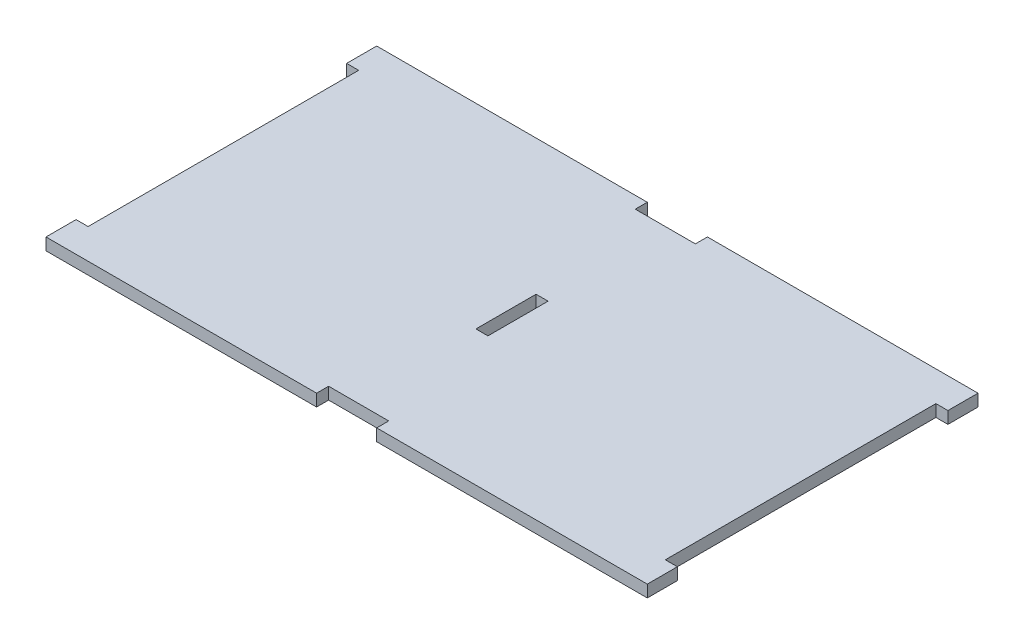
ISO-10303-21;
HEADER;
FILE_DESCRIPTION(('STEP AP214'),'2;1');
FILE_NAME('part.step','',(''),(''),'','','');
FILE_SCHEMA(('AUTOMOTIVE_DESIGN { 1 0 10303 214 1 1 1 1 }'));
ENDSEC;
DATA;
#1=APPLICATION_CONTEXT('core data for automotive mechanical design processes');
#2=APPLICATION_PROTOCOL_DEFINITION('international standard','automotive_design',2000,#1);
#3=PRODUCT_CONTEXT('',#1,'mechanical');
#4=PRODUCT('Part','Part','',(#3));
#5=PRODUCT_RELATED_PRODUCT_CATEGORY('part','',(#4));
#6=PRODUCT_DEFINITION_FORMATION('','',#4);
#7=PRODUCT_DEFINITION_CONTEXT('part definition',#1,'design');
#8=PRODUCT_DEFINITION('design','',#6,#7);
#9=PRODUCT_DEFINITION_SHAPE('','',#8);
#10=(LENGTH_UNIT() NAMED_UNIT(*) SI_UNIT(.MILLI.,.METRE.));
#11=(NAMED_UNIT(*) PLANE_ANGLE_UNIT() SI_UNIT($,.RADIAN.));
#12=(NAMED_UNIT(*) SI_UNIT($,.STERADIAN.) SOLID_ANGLE_UNIT());
#13=UNCERTAINTY_MEASURE_WITH_UNIT(LENGTH_MEASURE(1.E-05),#10,'distance_accuracy_value','');
#14=(GEOMETRIC_REPRESENTATION_CONTEXT(3) GLOBAL_UNCERTAINTY_ASSIGNED_CONTEXT((#13)) GLOBAL_UNIT_ASSIGNED_CONTEXT((#10,
#11,#12)) REPRESENTATION_CONTEXT('',''));
#15=CARTESIAN_POINT('',(0.,0.,0.));
#16=DIRECTION('',(0.,0.,1.));
#17=DIRECTION('',(1.,0.,0.));
#18=AXIS2_PLACEMENT_3D('',#15,#16,#17);
#19=CARTESIAN_POINT('',(0.,2.,0.));
#20=DIRECTION('',(0.,1.,0.));
#21=DIRECTION('',(0.,0.,1.));
#22=AXIS2_PLACEMENT_3D('',#19,#20,#21);
#23=PLANE('',#22);
#24=DIRECTION('',(1.,0.,0.));
#25=VECTOR('',#24,1.);
#26=CARTESIAN_POINT('',(-50.,2.,27.5));
#27=LINE('',#26,#25);
#28=CARTESIAN_POINT('',(-50.,2.,27.5));
#29=VERTEX_POINT('',#28);
#30=CARTESIAN_POINT('',(-5.,2.,27.5));
#31=VERTEX_POINT('',#30);
#32=EDGE_CURVE('E231',#29,#31,#27,.T.);
#33=ORIENTED_EDGE('',*,*,#32,.T.);
#34=DIRECTION('',(0.,0.,-1.));
#35=VECTOR('',#34,1.);
#36=CARTESIAN_POINT('',(-5.,2.,27.5));
#37=LINE('',#36,#35);
#38=CARTESIAN_POINT('',(-5.,2.,25.5));
#39=VERTEX_POINT('',#38);
#40=EDGE_CURVE('E234',#31,#39,#37,.T.);
#41=ORIENTED_EDGE('',*,*,#40,.T.);
#42=DIRECTION('',(1.,0.,0.));
#43=VECTOR('',#42,1.);
#44=CARTESIAN_POINT('',(-5.,2.,25.5));
#45=LINE('',#44,#43);
#46=CARTESIAN_POINT('',(5.,2.,25.5));
#47=VERTEX_POINT('',#46);
#48=EDGE_CURVE('E237',#39,#47,#45,.T.);
#49=ORIENTED_EDGE('',*,*,#48,.T.);
#50=DIRECTION('',(0.,0.,1.));
#51=VECTOR('',#50,1.);
#52=CARTESIAN_POINT('',(5.,2.,25.5));
#53=LINE('',#52,#51);
#54=CARTESIAN_POINT('',(5.,2.,27.5));
#55=VERTEX_POINT('',#54);
#56=EDGE_CURVE('E239',#47,#55,#53,.T.);
#57=ORIENTED_EDGE('',*,*,#56,.T.);
#58=DIRECTION('',(1.,0.,0.));
#59=VECTOR('',#58,1.);
#60=CARTESIAN_POINT('',(5.,2.,27.5));
#61=LINE('',#60,#59);
#62=CARTESIAN_POINT('',(50.,2.,27.5));
#63=VERTEX_POINT('',#62);
#64=EDGE_CURVE('E241',#55,#63,#61,.T.);
#65=ORIENTED_EDGE('',*,*,#64,.T.);
#66=DIRECTION('',(0.,0.,-1.));
#67=VECTOR('',#66,1.);
#68=CARTESIAN_POINT('',(50.,2.,22.5));
#69=LINE('',#68,#67);
#70=CARTESIAN_POINT('',(50.,2.,22.5));
#71=VERTEX_POINT('',#70);
#72=EDGE_CURVE('E243',#63,#71,#69,.T.);
#73=ORIENTED_EDGE('',*,*,#72,.T.);
#74=DIRECTION('',(-1.,0.,0.));
#75=VECTOR('',#74,1.);
#76=CARTESIAN_POINT('',(48.,2.,22.5));
#77=LINE('',#76,#75);
#78=CARTESIAN_POINT('',(48.,2.,22.5));
#79=VERTEX_POINT('',#78);
#80=EDGE_CURVE('E245',#71,#79,#77,.T.);
#81=ORIENTED_EDGE('',*,*,#80,.T.);
#82=DIRECTION('',(0.,0.,-1.));
#83=VECTOR('',#82,1.);
#84=CARTESIAN_POINT('',(48.,2.,-22.5));
#85=LINE('',#84,#83);
#86=CARTESIAN_POINT('',(48.,2.,-22.5));
#87=VERTEX_POINT('',#86);
#88=EDGE_CURVE('E247',#79,#87,#85,.T.);
#89=ORIENTED_EDGE('',*,*,#88,.T.);
#90=DIRECTION('',(1.,0.,0.));
#91=VECTOR('',#90,1.);
#92=CARTESIAN_POINT('',(50.,2.,-22.5));
#93=LINE('',#92,#91);
#94=CARTESIAN_POINT('',(50.,2.,-22.5));
#95=VERTEX_POINT('',#94);
#96=EDGE_CURVE('E249',#87,#95,#93,.T.);
#97=ORIENTED_EDGE('',*,*,#96,.T.);
#98=DIRECTION('',(0.,0.,-1.));
#99=VECTOR('',#98,1.);
#100=CARTESIAN_POINT('',(50.,2.,-27.5));
#101=LINE('',#100,#99);
#102=CARTESIAN_POINT('',(50.,2.,-27.5));
#103=VERTEX_POINT('',#102);
#104=EDGE_CURVE('E251',#95,#103,#101,.T.);
#105=ORIENTED_EDGE('',*,*,#104,.T.);
#106=DIRECTION('',(-1.,0.,0.));
#107=VECTOR('',#106,1.);
#108=CARTESIAN_POINT('',(5.,2.,-27.5));
#109=LINE('',#108,#107);
#110=CARTESIAN_POINT('',(5.,2.,-27.5));
#111=VERTEX_POINT('',#110);
#112=EDGE_CURVE('E253',#103,#111,#109,.T.);
#113=ORIENTED_EDGE('',*,*,#112,.T.);
#114=DIRECTION('',(0.,0.,1.));
#115=VECTOR('',#114,1.);
#116=CARTESIAN_POINT('',(5.,2.,-25.5));
#117=LINE('',#116,#115);
#118=CARTESIAN_POINT('',(5.,2.,-25.5));
#119=VERTEX_POINT('',#118);
#120=EDGE_CURVE('E255',#111,#119,#117,.T.);
#121=ORIENTED_EDGE('',*,*,#120,.T.);
#122=DIRECTION('',(-1.,0.,0.));
#123=VECTOR('',#122,1.);
#124=CARTESIAN_POINT('',(-5.,2.,-25.5));
#125=LINE('',#124,#123);
#126=CARTESIAN_POINT('',(-5.,2.,-25.5));
#127=VERTEX_POINT('',#126);
#128=EDGE_CURVE('E257',#119,#127,#125,.T.);
#129=ORIENTED_EDGE('',*,*,#128,.T.);
#130=DIRECTION('',(0.,0.,-1.));
#131=VECTOR('',#130,1.);
#132=CARTESIAN_POINT('',(-5.,2.,-27.5));
#133=LINE('',#132,#131);
#134=CARTESIAN_POINT('',(-5.,2.,-27.5));
#135=VERTEX_POINT('',#134);
#136=EDGE_CURVE('E259',#127,#135,#133,.T.);
#137=ORIENTED_EDGE('',*,*,#136,.T.);
#138=DIRECTION('',(-1.,0.,0.));
#139=VECTOR('',#138,1.);
#140=CARTESIAN_POINT('',(-50.,2.,-27.5));
#141=LINE('',#140,#139);
#142=CARTESIAN_POINT('',(-50.,2.,-27.5));
#143=VERTEX_POINT('',#142);
#144=EDGE_CURVE('E261',#135,#143,#141,.T.);
#145=ORIENTED_EDGE('',*,*,#144,.T.);
#146=DIRECTION('',(0.,0.,1.));
#147=VECTOR('',#146,1.);
#148=CARTESIAN_POINT('',(-50.,2.,-27.5));
#149=LINE('',#148,#147);
#150=CARTESIAN_POINT('',(-50.,2.,-22.5));
#151=VERTEX_POINT('',#150);
#152=EDGE_CURVE('E263',#143,#151,#149,.T.);
#153=ORIENTED_EDGE('',*,*,#152,.T.);
#154=DIRECTION('',(1.,0.,0.));
#155=VECTOR('',#154,1.);
#156=CARTESIAN_POINT('',(-50.,2.,-22.5));
#157=LINE('',#156,#155);
#158=CARTESIAN_POINT('',(-48.,2.,-22.5));
#159=VERTEX_POINT('',#158);
#160=EDGE_CURVE('E265',#151,#159,#157,.T.);
#161=ORIENTED_EDGE('',*,*,#160,.T.);
#162=DIRECTION('',(0.,0.,1.));
#163=VECTOR('',#162,1.);
#164=CARTESIAN_POINT('',(-48.,2.,-22.5));
#165=LINE('',#164,#163);
#166=CARTESIAN_POINT('',(-48.,2.,22.5));
#167=VERTEX_POINT('',#166);
#168=EDGE_CURVE('E267',#159,#167,#165,.T.);
#169=ORIENTED_EDGE('',*,*,#168,.T.);
#170=DIRECTION('',(-1.,0.,0.));
#171=VECTOR('',#170,1.);
#172=CARTESIAN_POINT('',(-48.,2.,22.5));
#173=LINE('',#172,#171);
#174=CARTESIAN_POINT('',(-50.,2.,22.5));
#175=VERTEX_POINT('',#174);
#176=EDGE_CURVE('E269',#167,#175,#173,.T.);
#177=ORIENTED_EDGE('',*,*,#176,.T.);
#178=DIRECTION('',(0.,0.,1.));
#179=VECTOR('',#178,1.);
#180=CARTESIAN_POINT('',(-50.,2.,22.5));
#181=LINE('',#180,#179);
#182=EDGE_CURVE('E271',#175,#29,#181,.T.);
#183=ORIENTED_EDGE('',*,*,#182,.T.);
#184=EDGE_LOOP('',(#33,#41,#49,#57,#65,#73,#81,#89,#97,#105,#113,#121,#129,#137,#145,#153,#161,
#169,#177,#183));
#185=FACE_BOUND('',#184,.T.);
#186=DIRECTION('',(1.,0.,0.));
#187=VECTOR('',#186,1.);
#188=CARTESIAN_POINT('',(-0.999999999999999,2.,5.));
#189=LINE('',#188,#187);
#190=CARTESIAN_POINT('',(-0.999999999999999,2.,5.));
#191=VERTEX_POINT('',#190);
#192=CARTESIAN_POINT('',(1.,2.,5.));
#193=VERTEX_POINT('',#192);
#194=EDGE_CURVE('E203',#191,#193,#189,.T.);
#195=ORIENTED_EDGE('',*,*,#194,.F.);
#196=DIRECTION('',(0.,0.,1.));
#197=VECTOR('',#196,1.);
#198=CARTESIAN_POINT('',(-1.,2.,-5.));
#199=LINE('',#198,#197);
#200=CARTESIAN_POINT('',(-1.,2.,-5.));
#201=VERTEX_POINT('',#200);
#202=EDGE_CURVE('E195',#201,#191,#199,.T.);
#203=ORIENTED_EDGE('',*,*,#202,.F.);
#204=DIRECTION('',(-1.,0.,0.));
#205=VECTOR('',#204,1.);
#206=CARTESIAN_POINT('',(-1.,2.,-5.));
#207=LINE('',#206,#205);
#208=CARTESIAN_POINT('',(1.,2.,-5.));
#209=VERTEX_POINT('',#208);
#210=EDGE_CURVE('E217',#209,#201,#207,.T.);
#211=ORIENTED_EDGE('',*,*,#210,.F.);
#212=DIRECTION('',(0.,0.,-1.));
#213=VECTOR('',#212,1.);
#214=CARTESIAN_POINT('',(1.,2.,-5.));
#215=LINE('',#214,#213);
#216=EDGE_CURVE('E215',#193,#209,#215,.T.);
#217=ORIENTED_EDGE('',*,*,#216,.F.);
#218=EDGE_LOOP('',(#195,#203,#211,#217));
#219=FACE_BOUND('',#218,.T.);
#220=ADVANCED_FACE('F34',(#185,#219),#23,.T.);
#221=CARTESIAN_POINT('',(0.,0.,0.));
#222=DIRECTION('',(0.,1.,0.));
#223=DIRECTION('',(0.,0.,1.));
#224=AXIS2_PLACEMENT_3D('',#221,#222,#223);
#225=PLANE('',#224);
#226=DIRECTION('',(1.,0.,0.));
#227=VECTOR('',#226,1.);
#228=CARTESIAN_POINT('',(-50.,0.,27.5));
#229=LINE('',#228,#227);
#230=CARTESIAN_POINT('',(-50.,0.,27.5));
#231=VERTEX_POINT('',#230);
#232=CARTESIAN_POINT('',(-5.,0.,27.5));
#233=VERTEX_POINT('',#232);
#234=EDGE_CURVE('E211',#231,#233,#229,.T.);
#235=ORIENTED_EDGE('',*,*,#234,.F.);
#236=DIRECTION('',(0.,0.,1.));
#237=VECTOR('',#236,1.);
#238=CARTESIAN_POINT('',(-50.,0.,22.5));
#239=LINE('',#238,#237);
#240=CARTESIAN_POINT('',(-50.,0.,22.5));
#241=VERTEX_POINT('',#240);
#242=EDGE_CURVE('E235',#241,#231,#239,.T.);
#243=ORIENTED_EDGE('',*,*,#242,.F.);
#244=DIRECTION('',(-1.,0.,0.));
#245=VECTOR('',#244,1.);
#246=CARTESIAN_POINT('',(-48.,0.,22.5));
#247=LINE('',#246,#245);
#248=CARTESIAN_POINT('',(-48.,0.,22.5));
#249=VERTEX_POINT('',#248);
#250=EDGE_CURVE('E310',#249,#241,#247,.T.);
#251=ORIENTED_EDGE('',*,*,#250,.F.);
#252=DIRECTION('',(0.,0.,1.));
#253=VECTOR('',#252,1.);
#254=CARTESIAN_POINT('',(-48.,0.,-22.5));
#255=LINE('',#254,#253);
#256=CARTESIAN_POINT('',(-48.,0.,-22.5));
#257=VERTEX_POINT('',#256);
#258=EDGE_CURVE('E308',#257,#249,#255,.T.);
#259=ORIENTED_EDGE('',*,*,#258,.F.);
#260=DIRECTION('',(1.,0.,0.));
#261=VECTOR('',#260,1.);
#262=CARTESIAN_POINT('',(-50.,0.,-22.5));
#263=LINE('',#262,#261);
#264=CARTESIAN_POINT('',(-50.,0.,-22.5));
#265=VERTEX_POINT('',#264);
#266=EDGE_CURVE('E306',#265,#257,#263,.T.);
#267=ORIENTED_EDGE('',*,*,#266,.F.);
#268=DIRECTION('',(0.,0.,1.));
#269=VECTOR('',#268,1.);
#270=CARTESIAN_POINT('',(-50.,0.,-27.5));
#271=LINE('',#270,#269);
#272=CARTESIAN_POINT('',(-50.,0.,-27.5));
#273=VERTEX_POINT('',#272);
#274=EDGE_CURVE('E304',#273,#265,#271,.T.);
#275=ORIENTED_EDGE('',*,*,#274,.F.);
#276=DIRECTION('',(-1.,0.,0.));
#277=VECTOR('',#276,1.);
#278=CARTESIAN_POINT('',(-50.,0.,-27.5));
#279=LINE('',#278,#277);
#280=CARTESIAN_POINT('',(-5.,0.,-27.5));
#281=VERTEX_POINT('',#280);
#282=EDGE_CURVE('E302',#281,#273,#279,.T.);
#283=ORIENTED_EDGE('',*,*,#282,.F.);
#284=DIRECTION('',(0.,0.,-1.));
#285=VECTOR('',#284,1.);
#286=CARTESIAN_POINT('',(-5.,0.,-27.5));
#287=LINE('',#286,#285);
#288=CARTESIAN_POINT('',(-5.,0.,-25.5));
#289=VERTEX_POINT('',#288);
#290=EDGE_CURVE('E300',#289,#281,#287,.T.);
#291=ORIENTED_EDGE('',*,*,#290,.F.);
#292=DIRECTION('',(-1.,0.,0.));
#293=VECTOR('',#292,1.);
#294=CARTESIAN_POINT('',(-5.,0.,-25.5));
#295=LINE('',#294,#293);
#296=CARTESIAN_POINT('',(5.,0.,-25.5));
#297=VERTEX_POINT('',#296);
#298=EDGE_CURVE('E298',#297,#289,#295,.T.);
#299=ORIENTED_EDGE('',*,*,#298,.F.);
#300=DIRECTION('',(0.,0.,1.));
#301=VECTOR('',#300,1.);
#302=CARTESIAN_POINT('',(5.,0.,-25.5));
#303=LINE('',#302,#301);
#304=CARTESIAN_POINT('',(5.,0.,-27.5));
#305=VERTEX_POINT('',#304);
#306=EDGE_CURVE('E296',#305,#297,#303,.T.);
#307=ORIENTED_EDGE('',*,*,#306,.F.);
#308=DIRECTION('',(-1.,0.,0.));
#309=VECTOR('',#308,1.);
#310=CARTESIAN_POINT('',(5.,0.,-27.5));
#311=LINE('',#310,#309);
#312=CARTESIAN_POINT('',(50.,0.,-27.5));
#313=VERTEX_POINT('',#312);
#314=EDGE_CURVE('E294',#313,#305,#311,.T.);
#315=ORIENTED_EDGE('',*,*,#314,.F.);
#316=DIRECTION('',(0.,0.,-1.));
#317=VECTOR('',#316,1.);
#318=CARTESIAN_POINT('',(50.,0.,-27.5));
#319=LINE('',#318,#317);
#320=CARTESIAN_POINT('',(50.,0.,-22.5));
#321=VERTEX_POINT('',#320);
#322=EDGE_CURVE('E292',#321,#313,#319,.T.);
#323=ORIENTED_EDGE('',*,*,#322,.F.);
#324=DIRECTION('',(1.,0.,0.));
#325=VECTOR('',#324,1.);
#326=CARTESIAN_POINT('',(50.,0.,-22.5));
#327=LINE('',#326,#325);
#328=CARTESIAN_POINT('',(48.,0.,-22.5));
#329=VERTEX_POINT('',#328);
#330=EDGE_CURVE('E290',#329,#321,#327,.T.);
#331=ORIENTED_EDGE('',*,*,#330,.F.);
#332=DIRECTION('',(0.,0.,-1.));
#333=VECTOR('',#332,1.);
#334=CARTESIAN_POINT('',(48.,0.,-22.5));
#335=LINE('',#334,#333);
#336=CARTESIAN_POINT('',(48.,0.,22.5));
#337=VERTEX_POINT('',#336);
#338=EDGE_CURVE('E288',#337,#329,#335,.T.);
#339=ORIENTED_EDGE('',*,*,#338,.F.);
#340=DIRECTION('',(-1.,0.,0.));
#341=VECTOR('',#340,1.);
#342=CARTESIAN_POINT('',(48.,0.,22.5));
#343=LINE('',#342,#341);
#344=CARTESIAN_POINT('',(50.,0.,22.5));
#345=VERTEX_POINT('',#344);
#346=EDGE_CURVE('E286',#345,#337,#343,.T.);
#347=ORIENTED_EDGE('',*,*,#346,.F.);
#348=DIRECTION('',(0.,0.,-1.));
#349=VECTOR('',#348,1.);
#350=CARTESIAN_POINT('',(50.,0.,22.5));
#351=LINE('',#350,#349);
#352=CARTESIAN_POINT('',(50.,0.,27.5));
#353=VERTEX_POINT('',#352);
#354=EDGE_CURVE('E284',#353,#345,#351,.T.);
#355=ORIENTED_EDGE('',*,*,#354,.F.);
#356=DIRECTION('',(1.,0.,0.));
#357=VECTOR('',#356,1.);
#358=CARTESIAN_POINT('',(5.,0.,27.5));
#359=LINE('',#358,#357);
#360=CARTESIAN_POINT('',(5.,0.,27.5));
#361=VERTEX_POINT('',#360);
#362=EDGE_CURVE('E282',#361,#353,#359,.T.);
#363=ORIENTED_EDGE('',*,*,#362,.F.);
#364=DIRECTION('',(0.,0.,1.));
#365=VECTOR('',#364,1.);
#366=CARTESIAN_POINT('',(5.,0.,25.5));
#367=LINE('',#366,#365);
#368=CARTESIAN_POINT('',(5.,0.,25.5));
#369=VERTEX_POINT('',#368);
#370=EDGE_CURVE('E280',#369,#361,#367,.T.);
#371=ORIENTED_EDGE('',*,*,#370,.F.);
#372=DIRECTION('',(1.,0.,0.));
#373=VECTOR('',#372,1.);
#374=CARTESIAN_POINT('',(-5.,0.,25.5));
#375=LINE('',#374,#373);
#376=CARTESIAN_POINT('',(-5.,0.,25.5));
#377=VERTEX_POINT('',#376);
#378=EDGE_CURVE('E278',#377,#369,#375,.T.);
#379=ORIENTED_EDGE('',*,*,#378,.F.);
#380=DIRECTION('',(0.,0.,-1.));
#381=VECTOR('',#380,1.);
#382=CARTESIAN_POINT('',(-5.,0.,27.5));
#383=LINE('',#382,#381);
#384=EDGE_CURVE('E276',#233,#377,#383,.T.);
#385=ORIENTED_EDGE('',*,*,#384,.F.);
#386=EDGE_LOOP('',(#235,#243,#251,#259,#267,#275,#283,#291,#299,#307,#315,#323,#331,#339,#347,
#355,#363,#371,#379,#385));
#387=FACE_BOUND('',#386,.T.);
#388=DIRECTION('',(0.,0.,1.));
#389=VECTOR('',#388,1.);
#390=CARTESIAN_POINT('',(-1.,0.,-5.));
#391=LINE('',#390,#389);
#392=CARTESIAN_POINT('',(-1.,0.,-5.));
#393=VERTEX_POINT('',#392);
#394=CARTESIAN_POINT('',(-0.999999999999999,0.,5.));
#395=VERTEX_POINT('',#394);
#396=EDGE_CURVE('E57',#393,#395,#391,.T.);
#397=ORIENTED_EDGE('',*,*,#396,.T.);
#398=DIRECTION('',(1.,0.,0.));
#399=VECTOR('',#398,1.);
#400=CARTESIAN_POINT('',(-0.999999999999999,0.,5.));
#401=LINE('',#400,#399);
#402=CARTESIAN_POINT('',(1.,0.,5.));
#403=VERTEX_POINT('',#402);
#404=EDGE_CURVE('E210',#395,#403,#401,.T.);
#405=ORIENTED_EDGE('',*,*,#404,.T.);
#406=DIRECTION('',(0.,0.,-1.));
#407=VECTOR('',#406,1.);
#408=CARTESIAN_POINT('',(1.,0.,-5.));
#409=LINE('',#408,#407);
#410=CARTESIAN_POINT('',(1.,0.,-5.));
#411=VERTEX_POINT('',#410);
#412=EDGE_CURVE('E223',#403,#411,#409,.T.);
#413=ORIENTED_EDGE('',*,*,#412,.T.);
#414=DIRECTION('',(-1.,0.,0.));
#415=VECTOR('',#414,1.);
#416=CARTESIAN_POINT('',(-1.,0.,-5.));
#417=LINE('',#416,#415);
#418=EDGE_CURVE('E204',#411,#393,#417,.T.);
#419=ORIENTED_EDGE('',*,*,#418,.T.);
#420=EDGE_LOOP('',(#397,#405,#413,#419));
#421=FACE_BOUND('',#420,.T.);
#422=ADVANCED_FACE('F376',(#387,#421),#225,.F.);
#423=CARTESIAN_POINT('',(-50.,2.,27.5));
#424=DIRECTION('',(0.,0.,-1.));
#425=DIRECTION('',(-1.,0.,0.));
#426=AXIS2_PLACEMENT_3D('',#423,#424,#425);
#427=PLANE('',#426);
#428=ORIENTED_EDGE('',*,*,#234,.T.);
#429=DIRECTION('',(0.,-1.,0.));
#430=VECTOR('',#429,1.);
#431=CARTESIAN_POINT('',(-5.,2.,27.5));
#432=LINE('',#431,#430);
#433=EDGE_CURVE('E11',#31,#233,#432,.T.);
#434=ORIENTED_EDGE('',*,*,#433,.F.);
#435=ORIENTED_EDGE('',*,*,#32,.F.);
#436=DIRECTION('',(0.,-1.,0.));
#437=VECTOR('',#436,1.);
#438=CARTESIAN_POINT('',(-50.,2.,27.5));
#439=LINE('',#438,#437);
#440=EDGE_CURVE('E273',#29,#231,#439,.T.);
#441=ORIENTED_EDGE('',*,*,#440,.T.);
#442=EDGE_LOOP('',(#428,#434,#435,#441));
#443=FACE_BOUND('',#442,.T.);
#444=ADVANCED_FACE('F36',(#443),#427,.F.);
#445=CARTESIAN_POINT('',(-5.,2.,27.5));
#446=DIRECTION('',(-1.,0.,0.));
#447=DIRECTION('',(0.,0.,1.));
#448=AXIS2_PLACEMENT_3D('',#445,#446,#447);
#449=PLANE('',#448);
#450=ORIENTED_EDGE('',*,*,#384,.T.);
#451=DIRECTION('',(0.,-1.,0.));
#452=VECTOR('',#451,1.);
#453=CARTESIAN_POINT('',(-5.,2.,25.5));
#454=LINE('',#453,#452);
#455=EDGE_CURVE('E42',#39,#377,#454,.T.);
#456=ORIENTED_EDGE('',*,*,#455,.F.);
#457=ORIENTED_EDGE('',*,*,#40,.F.);
#458=ORIENTED_EDGE('',*,*,#433,.T.);
#459=EDGE_LOOP('',(#450,#456,#457,#458));
#460=FACE_BOUND('',#459,.T.);
#461=ADVANCED_FACE('F393',(#460),#449,.F.);
#462=CARTESIAN_POINT('',(-5.,2.,25.5));
#463=DIRECTION('',(0.,0.,-1.));
#464=DIRECTION('',(-1.,0.,0.));
#465=AXIS2_PLACEMENT_3D('',#462,#463,#464);
#466=PLANE('',#465);
#467=ORIENTED_EDGE('',*,*,#378,.T.);
#468=DIRECTION('',(0.,-1.,0.));
#469=VECTOR('',#468,1.);
#470=CARTESIAN_POINT('',(5.,2.,25.5));
#471=LINE('',#470,#469);
#472=EDGE_CURVE('E363',#47,#369,#471,.T.);
#473=ORIENTED_EDGE('',*,*,#472,.F.);
#474=ORIENTED_EDGE('',*,*,#48,.F.);
#475=ORIENTED_EDGE('',*,*,#455,.T.);
#476=EDGE_LOOP('',(#467,#473,#474,#475));
#477=FACE_BOUND('',#476,.T.);
#478=ADVANCED_FACE('F370',(#477),#466,.F.);
#479=CARTESIAN_POINT('',(5.,2.,25.5));
#480=DIRECTION('',(1.,0.,0.));
#481=DIRECTION('',(0.,0.,-1.));
#482=AXIS2_PLACEMENT_3D('',#479,#480,#481);
#483=PLANE('',#482);
#484=ORIENTED_EDGE('',*,*,#370,.T.);
#485=DIRECTION('',(0.,-1.,0.));
#486=VECTOR('',#485,1.);
#487=CARTESIAN_POINT('',(5.,2.,27.5));
#488=LINE('',#487,#486);
#489=EDGE_CURVE('E360',#55,#361,#488,.T.);
#490=ORIENTED_EDGE('',*,*,#489,.F.);
#491=ORIENTED_EDGE('',*,*,#56,.F.);
#492=ORIENTED_EDGE('',*,*,#472,.T.);
#493=EDGE_LOOP('',(#484,#490,#491,#492));
#494=FACE_BOUND('',#493,.T.);
#495=ADVANCED_FACE('F382',(#494),#483,.F.);
#496=CARTESIAN_POINT('',(5.,2.,27.5));
#497=DIRECTION('',(0.,0.,-1.));
#498=DIRECTION('',(-1.,0.,0.));
#499=AXIS2_PLACEMENT_3D('',#496,#497,#498);
#500=PLANE('',#499);
#501=ORIENTED_EDGE('',*,*,#362,.T.);
#502=DIRECTION('',(0.,-1.,0.));
#503=VECTOR('',#502,1.);
#504=CARTESIAN_POINT('',(50.,2.,27.5));
#505=LINE('',#504,#503);
#506=EDGE_CURVE('E357',#63,#353,#505,.T.);
#507=ORIENTED_EDGE('',*,*,#506,.F.);
#508=ORIENTED_EDGE('',*,*,#64,.F.);
#509=ORIENTED_EDGE('',*,*,#489,.T.);
#510=EDGE_LOOP('',(#501,#507,#508,#509));
#511=FACE_BOUND('',#510,.T.);
#512=ADVANCED_FACE('F386',(#511),#500,.F.);
#513=CARTESIAN_POINT('',(50.,2.,22.5));
#514=DIRECTION('',(-1.,0.,0.));
#515=DIRECTION('',(0.,0.,1.));
#516=AXIS2_PLACEMENT_3D('',#513,#514,#515);
#517=PLANE('',#516);
#518=ORIENTED_EDGE('',*,*,#354,.T.);
#519=DIRECTION('',(0.,-1.,0.));
#520=VECTOR('',#519,1.);
#521=CARTESIAN_POINT('',(50.,2.,22.5));
#522=LINE('',#521,#520);
#523=EDGE_CURVE('E354',#71,#345,#522,.T.);
#524=ORIENTED_EDGE('',*,*,#523,.F.);
#525=ORIENTED_EDGE('',*,*,#72,.F.);
#526=ORIENTED_EDGE('',*,*,#506,.T.);
#527=EDGE_LOOP('',(#518,#524,#525,#526));
#528=FACE_BOUND('',#527,.T.);
#529=ADVANCED_FACE('F466',(#528),#517,.F.);
#530=CARTESIAN_POINT('',(48.,2.,22.5));
#531=DIRECTION('',(0.,0.,1.));
#532=DIRECTION('',(1.,0.,0.));
#533=AXIS2_PLACEMENT_3D('',#530,#531,#532);
#534=PLANE('',#533);
#535=ORIENTED_EDGE('',*,*,#346,.T.);
#536=DIRECTION('',(0.,-1.,0.));
#537=VECTOR('',#536,1.);
#538=CARTESIAN_POINT('',(48.,2.,22.5));
#539=LINE('',#538,#537);
#540=EDGE_CURVE('E351',#79,#337,#539,.T.);
#541=ORIENTED_EDGE('',*,*,#540,.F.);
#542=ORIENTED_EDGE('',*,*,#80,.F.);
#543=ORIENTED_EDGE('',*,*,#523,.T.);
#544=EDGE_LOOP('',(#535,#541,#542,#543));
#545=FACE_BOUND('',#544,.T.);
#546=ADVANCED_FACE('F464',(#545),#534,.F.);
#547=CARTESIAN_POINT('',(48.,2.,-22.5));
#548=DIRECTION('',(-1.,0.,0.));
#549=DIRECTION('',(0.,0.,1.));
#550=AXIS2_PLACEMENT_3D('',#547,#548,#549);
#551=PLANE('',#550);
#552=ORIENTED_EDGE('',*,*,#338,.T.);
#553=DIRECTION('',(0.,-1.,0.));
#554=VECTOR('',#553,1.);
#555=CARTESIAN_POINT('',(48.,2.,-22.5));
#556=LINE('',#555,#554);
#557=EDGE_CURVE('E348',#87,#329,#556,.T.);
#558=ORIENTED_EDGE('',*,*,#557,.F.);
#559=ORIENTED_EDGE('',*,*,#88,.F.);
#560=ORIENTED_EDGE('',*,*,#540,.T.);
#561=EDGE_LOOP('',(#552,#558,#559,#560));
#562=FACE_BOUND('',#561,.T.);
#563=ADVANCED_FACE('F459',(#562),#551,.F.);
#564=CARTESIAN_POINT('',(50.,2.,-22.5));
#565=DIRECTION('',(0.,0.,-1.));
#566=DIRECTION('',(-1.,0.,0.));
#567=AXIS2_PLACEMENT_3D('',#564,#565,#566);
#568=PLANE('',#567);
#569=ORIENTED_EDGE('',*,*,#330,.T.);
#570=DIRECTION('',(0.,-1.,0.));
#571=VECTOR('',#570,1.);
#572=CARTESIAN_POINT('',(50.,2.,-22.5));
#573=LINE('',#572,#571);
#574=EDGE_CURVE('E345',#95,#321,#573,.T.);
#575=ORIENTED_EDGE('',*,*,#574,.F.);
#576=ORIENTED_EDGE('',*,*,#96,.F.);
#577=ORIENTED_EDGE('',*,*,#557,.T.);
#578=EDGE_LOOP('',(#569,#575,#576,#577));
#579=FACE_BOUND('',#578,.T.);
#580=ADVANCED_FACE('F454',(#579),#568,.F.);
#581=CARTESIAN_POINT('',(50.,2.,-27.5));
#582=DIRECTION('',(-1.,0.,0.));
#583=DIRECTION('',(0.,0.,1.));
#584=AXIS2_PLACEMENT_3D('',#581,#582,#583);
#585=PLANE('',#584);
#586=ORIENTED_EDGE('',*,*,#322,.T.);
#587=DIRECTION('',(0.,-1.,0.));
#588=VECTOR('',#587,1.);
#589=CARTESIAN_POINT('',(50.,2.,-27.5));
#590=LINE('',#589,#588);
#591=EDGE_CURVE('E342',#103,#313,#590,.T.);
#592=ORIENTED_EDGE('',*,*,#591,.F.);
#593=ORIENTED_EDGE('',*,*,#104,.F.);
#594=ORIENTED_EDGE('',*,*,#574,.T.);
#595=EDGE_LOOP('',(#586,#592,#593,#594));
#596=FACE_BOUND('',#595,.T.);
#597=ADVANCED_FACE('F450',(#596),#585,.F.);
#598=CARTESIAN_POINT('',(5.,2.,-27.5));
#599=DIRECTION('',(0.,0.,1.));
#600=DIRECTION('',(1.,0.,0.));
#601=AXIS2_PLACEMENT_3D('',#598,#599,#600);
#602=PLANE('',#601);
#603=ORIENTED_EDGE('',*,*,#314,.T.);
#604=DIRECTION('',(0.,-1.,0.));
#605=VECTOR('',#604,1.);
#606=CARTESIAN_POINT('',(5.,2.,-27.5));
#607=LINE('',#606,#605);
#608=EDGE_CURVE('E339',#111,#305,#607,.T.);
#609=ORIENTED_EDGE('',*,*,#608,.F.);
#610=ORIENTED_EDGE('',*,*,#112,.F.);
#611=ORIENTED_EDGE('',*,*,#591,.T.);
#612=EDGE_LOOP('',(#603,#609,#610,#611));
#613=FACE_BOUND('',#612,.T.);
#614=ADVANCED_FACE('F445',(#613),#602,.F.);
#615=CARTESIAN_POINT('',(5.,2.,-25.5));
#616=DIRECTION('',(1.,0.,0.));
#617=DIRECTION('',(0.,0.,-1.));
#618=AXIS2_PLACEMENT_3D('',#615,#616,#617);
#619=PLANE('',#618);
#620=ORIENTED_EDGE('',*,*,#306,.T.);
#621=DIRECTION('',(0.,-1.,0.));
#622=VECTOR('',#621,1.);
#623=CARTESIAN_POINT('',(5.,2.,-25.5));
#624=LINE('',#623,#622);
#625=EDGE_CURVE('E336',#119,#297,#624,.T.);
#626=ORIENTED_EDGE('',*,*,#625,.F.);
#627=ORIENTED_EDGE('',*,*,#120,.F.);
#628=ORIENTED_EDGE('',*,*,#608,.T.);
#629=EDGE_LOOP('',(#620,#626,#627,#628));
#630=FACE_BOUND('',#629,.T.);
#631=ADVANCED_FACE('F439',(#630),#619,.F.);
#632=CARTESIAN_POINT('',(-5.,2.,-25.5));
#633=DIRECTION('',(0.,0.,1.));
#634=DIRECTION('',(1.,0.,0.));
#635=AXIS2_PLACEMENT_3D('',#632,#633,#634);
#636=PLANE('',#635);
#637=ORIENTED_EDGE('',*,*,#298,.T.);
#638=DIRECTION('',(0.,-1.,0.));
#639=VECTOR('',#638,1.);
#640=CARTESIAN_POINT('',(-5.,2.,-25.5));
#641=LINE('',#640,#639);
#642=EDGE_CURVE('E333',#127,#289,#641,.T.);
#643=ORIENTED_EDGE('',*,*,#642,.F.);
#644=ORIENTED_EDGE('',*,*,#128,.F.);
#645=ORIENTED_EDGE('',*,*,#625,.T.);
#646=EDGE_LOOP('',(#637,#643,#644,#645));
#647=FACE_BOUND('',#646,.T.);
#648=ADVANCED_FACE('F435',(#647),#636,.F.);
#649=CARTESIAN_POINT('',(-5.,2.,-27.5));
#650=DIRECTION('',(-1.,0.,0.));
#651=DIRECTION('',(0.,0.,1.));
#652=AXIS2_PLACEMENT_3D('',#649,#650,#651);
#653=PLANE('',#652);
#654=ORIENTED_EDGE('',*,*,#290,.T.);
#655=DIRECTION('',(0.,-1.,0.));
#656=VECTOR('',#655,1.);
#657=CARTESIAN_POINT('',(-5.,2.,-27.5));
#658=LINE('',#657,#656);
#659=EDGE_CURVE('E330',#135,#281,#658,.T.);
#660=ORIENTED_EDGE('',*,*,#659,.F.);
#661=ORIENTED_EDGE('',*,*,#136,.F.);
#662=ORIENTED_EDGE('',*,*,#642,.T.);
#663=EDGE_LOOP('',(#654,#660,#661,#662));
#664=FACE_BOUND('',#663,.T.);
#665=ADVANCED_FACE('F430',(#664),#653,.F.);
#666=CARTESIAN_POINT('',(-50.,2.,-27.5));
#667=DIRECTION('',(0.,0.,1.));
#668=DIRECTION('',(1.,0.,0.));
#669=AXIS2_PLACEMENT_3D('',#666,#667,#668);
#670=PLANE('',#669);
#671=ORIENTED_EDGE('',*,*,#282,.T.);
#672=DIRECTION('',(0.,-1.,0.));
#673=VECTOR('',#672,1.);
#674=CARTESIAN_POINT('',(-50.,2.,-27.5));
#675=LINE('',#674,#673);
#676=EDGE_CURVE('E327',#143,#273,#675,.T.);
#677=ORIENTED_EDGE('',*,*,#676,.F.);
#678=ORIENTED_EDGE('',*,*,#144,.F.);
#679=ORIENTED_EDGE('',*,*,#659,.T.);
#680=EDGE_LOOP('',(#671,#677,#678,#679));
#681=FACE_BOUND('',#680,.T.);
#682=ADVANCED_FACE('F424',(#681),#670,.F.);
#683=CARTESIAN_POINT('',(-50.,2.,-27.5));
#684=DIRECTION('',(1.,0.,0.));
#685=DIRECTION('',(0.,0.,-1.));
#686=AXIS2_PLACEMENT_3D('',#683,#684,#685);
#687=PLANE('',#686);
#688=ORIENTED_EDGE('',*,*,#274,.T.);
#689=DIRECTION('',(0.,-1.,0.));
#690=VECTOR('',#689,1.);
#691=CARTESIAN_POINT('',(-50.,2.,-22.5));
#692=LINE('',#691,#690);
#693=EDGE_CURVE('E324',#151,#265,#692,.T.);
#694=ORIENTED_EDGE('',*,*,#693,.F.);
#695=ORIENTED_EDGE('',*,*,#152,.F.);
#696=ORIENTED_EDGE('',*,*,#676,.T.);
#697=EDGE_LOOP('',(#688,#694,#695,#696));
#698=FACE_BOUND('',#697,.T.);
#699=ADVANCED_FACE('F420',(#698),#687,.F.);
#700=CARTESIAN_POINT('',(-50.,2.,-22.5));
#701=DIRECTION('',(0.,0.,-1.));
#702=DIRECTION('',(-1.,0.,0.));
#703=AXIS2_PLACEMENT_3D('',#700,#701,#702);
#704=PLANE('',#703);
#705=ORIENTED_EDGE('',*,*,#266,.T.);
#706=DIRECTION('',(0.,-1.,0.));
#707=VECTOR('',#706,1.);
#708=CARTESIAN_POINT('',(-48.,2.,-22.5));
#709=LINE('',#708,#707);
#710=EDGE_CURVE('E321',#159,#257,#709,.T.);
#711=ORIENTED_EDGE('',*,*,#710,.F.);
#712=ORIENTED_EDGE('',*,*,#160,.F.);
#713=ORIENTED_EDGE('',*,*,#693,.T.);
#714=EDGE_LOOP('',(#705,#711,#712,#713));
#715=FACE_BOUND('',#714,.T.);
#716=ADVANCED_FACE('F415',(#715),#704,.F.);
#717=CARTESIAN_POINT('',(-48.,2.,-22.5));
#718=DIRECTION('',(1.,0.,0.));
#719=DIRECTION('',(0.,0.,-1.));
#720=AXIS2_PLACEMENT_3D('',#717,#718,#719);
#721=PLANE('',#720);
#722=ORIENTED_EDGE('',*,*,#258,.T.);
#723=DIRECTION('',(0.,-1.,0.));
#724=VECTOR('',#723,1.);
#725=CARTESIAN_POINT('',(-48.,2.,22.5));
#726=LINE('',#725,#724);
#727=EDGE_CURVE('E318',#167,#249,#726,.T.);
#728=ORIENTED_EDGE('',*,*,#727,.F.);
#729=ORIENTED_EDGE('',*,*,#168,.F.);
#730=ORIENTED_EDGE('',*,*,#710,.T.);
#731=EDGE_LOOP('',(#722,#728,#729,#730));
#732=FACE_BOUND('',#731,.T.);
#733=ADVANCED_FACE('F409',(#732),#721,.F.);
#734=CARTESIAN_POINT('',(-48.,2.,22.5));
#735=DIRECTION('',(0.,0.,1.));
#736=DIRECTION('',(1.,0.,0.));
#737=AXIS2_PLACEMENT_3D('',#734,#735,#736);
#738=PLANE('',#737);
#739=ORIENTED_EDGE('',*,*,#250,.T.);
#740=DIRECTION('',(0.,-1.,0.));
#741=VECTOR('',#740,1.);
#742=CARTESIAN_POINT('',(-50.,2.,22.5));
#743=LINE('',#742,#741);
#744=EDGE_CURVE('E315',#175,#241,#743,.T.);
#745=ORIENTED_EDGE('',*,*,#744,.F.);
#746=ORIENTED_EDGE('',*,*,#176,.F.);
#747=ORIENTED_EDGE('',*,*,#727,.T.);
#748=EDGE_LOOP('',(#739,#745,#746,#747));
#749=FACE_BOUND('',#748,.T.);
#750=ADVANCED_FACE('F405',(#749),#738,.F.);
#751=CARTESIAN_POINT('',(-50.,2.,22.5));
#752=DIRECTION('',(1.,0.,0.));
#753=DIRECTION('',(0.,0.,-1.));
#754=AXIS2_PLACEMENT_3D('',#751,#752,#753);
#755=PLANE('',#754);
#756=ORIENTED_EDGE('',*,*,#242,.T.);
#757=ORIENTED_EDGE('',*,*,#440,.F.);
#758=ORIENTED_EDGE('',*,*,#182,.F.);
#759=ORIENTED_EDGE('',*,*,#744,.T.);
#760=EDGE_LOOP('',(#756,#757,#758,#759));
#761=FACE_BOUND('',#760,.T.);
#762=ADVANCED_FACE('F400',(#761),#755,.F.);
#763=CARTESIAN_POINT('',(-1.,2.,-5.));
#764=DIRECTION('',(1.,0.,0.));
#765=DIRECTION('',(0.,0.,-1.));
#766=AXIS2_PLACEMENT_3D('',#763,#764,#765);
#767=PLANE('',#766);
#768=ORIENTED_EDGE('',*,*,#396,.F.);
#769=DIRECTION('',(0.,-1.,0.));
#770=VECTOR('',#769,1.);
#771=CARTESIAN_POINT('',(-1.,2.,-5.));
#772=LINE('',#771,#770);
#773=EDGE_CURVE('E199',#201,#393,#772,.T.);
#774=ORIENTED_EDGE('',*,*,#773,.F.);
#775=ORIENTED_EDGE('',*,*,#202,.T.);
#776=DIRECTION('',(0.,-1.,0.));
#777=VECTOR('',#776,1.);
#778=CARTESIAN_POINT('',(-0.999999999999999,2.,5.));
#779=LINE('',#778,#777);
#780=EDGE_CURVE('E198',#191,#395,#779,.T.);
#781=ORIENTED_EDGE('',*,*,#780,.T.);
#782=EDGE_LOOP('',(#768,#774,#775,#781));
#783=FACE_BOUND('',#782,.T.);
#784=ADVANCED_FACE('F197',(#783),#767,.T.);
#785=CARTESIAN_POINT('',(-0.999999999999999,2.,5.));
#786=DIRECTION('',(0.,0.,-1.));
#787=DIRECTION('',(-1.,0.,0.));
#788=AXIS2_PLACEMENT_3D('',#785,#786,#787);
#789=PLANE('',#788);
#790=ORIENTED_EDGE('',*,*,#404,.F.);
#791=ORIENTED_EDGE('',*,*,#780,.F.);
#792=ORIENTED_EDGE('',*,*,#194,.T.);
#793=DIRECTION('',(0.,-1.,0.));
#794=VECTOR('',#793,1.);
#795=CARTESIAN_POINT('',(1.,2.,5.));
#796=LINE('',#795,#794);
#797=EDGE_CURVE('E212',#193,#403,#796,.T.);
#798=ORIENTED_EDGE('',*,*,#797,.T.);
#799=EDGE_LOOP('',(#790,#791,#792,#798));
#800=FACE_BOUND('',#799,.T.);
#801=ADVANCED_FACE('F207',(#800),#789,.T.);
#802=CARTESIAN_POINT('',(1.,2.,-5.));
#803=DIRECTION('',(-1.,0.,0.));
#804=DIRECTION('',(0.,0.,1.));
#805=AXIS2_PLACEMENT_3D('',#802,#803,#804);
#806=PLANE('',#805);
#807=ORIENTED_EDGE('',*,*,#412,.F.);
#808=ORIENTED_EDGE('',*,*,#797,.F.);
#809=ORIENTED_EDGE('',*,*,#216,.T.);
#810=DIRECTION('',(0.,-1.,0.));
#811=VECTOR('',#810,1.);
#812=CARTESIAN_POINT('',(1.,2.,-5.));
#813=LINE('',#812,#811);
#814=EDGE_CURVE('E49',#209,#411,#813,.T.);
#815=ORIENTED_EDGE('',*,*,#814,.T.);
#816=EDGE_LOOP('',(#807,#808,#809,#815));
#817=FACE_BOUND('',#816,.T.);
#818=ADVANCED_FACE('F572',(#817),#806,.T.);
#819=CARTESIAN_POINT('',(-1.,2.,-5.));
#820=DIRECTION('',(0.,0.,1.));
#821=DIRECTION('',(1.,0.,0.));
#822=AXIS2_PLACEMENT_3D('',#819,#820,#821);
#823=PLANE('',#822);
#824=ORIENTED_EDGE('',*,*,#418,.F.);
#825=ORIENTED_EDGE('',*,*,#814,.F.);
#826=ORIENTED_EDGE('',*,*,#210,.T.);
#827=ORIENTED_EDGE('',*,*,#773,.T.);
#828=EDGE_LOOP('',(#824,#825,#826,#827));
#829=FACE_BOUND('',#828,.T.);
#830=ADVANCED_FACE('F578',(#829),#823,.T.);
#831=CLOSED_SHELL('',(#220,#422,#444,#461,#478,#495,#512,#529,#546,#563,#580,#597,#614,#631,
#648,#665,#682,#699,#716,#733,#750,#762,#784,#801,#818,#830));
#832=MANIFOLD_SOLID_BREP('B2',#831);
#833=ADVANCED_BREP_SHAPE_REPRESENTATION('',(#18,#832),#14);
#834=SHAPE_DEFINITION_REPRESENTATION(#9,#833);
ENDSEC;
END-ISO-10303-21;
